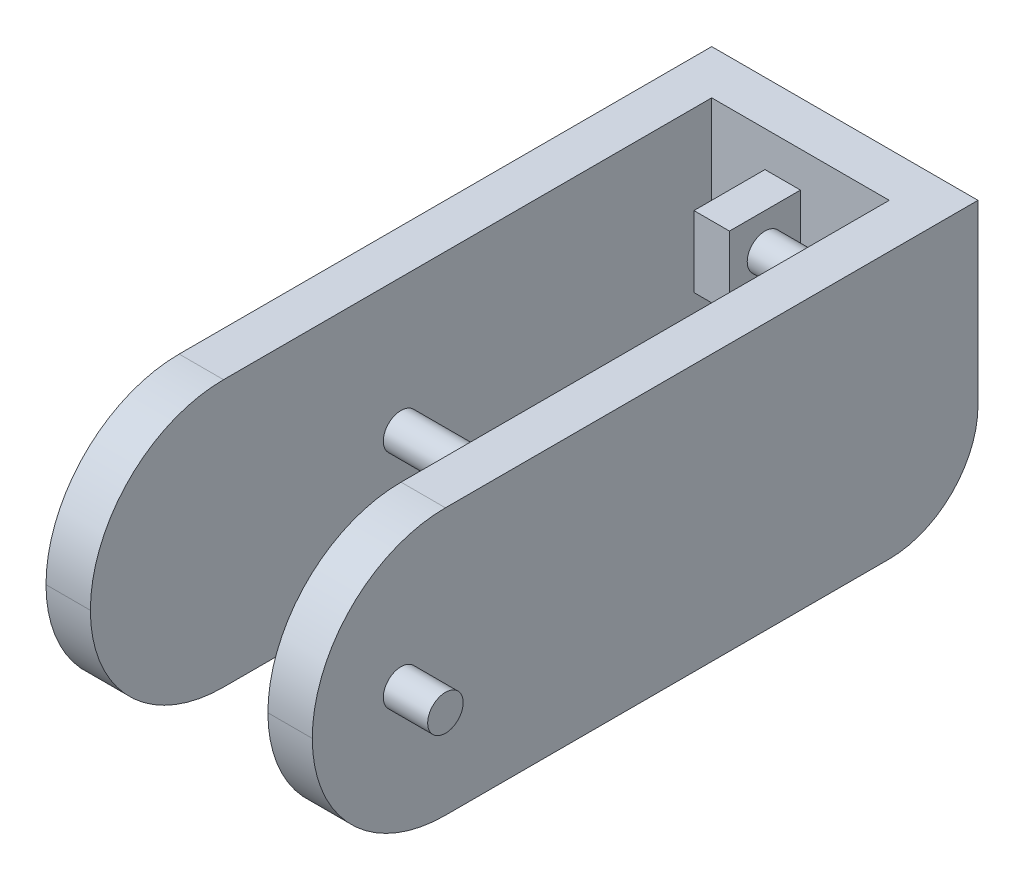
ISO-10303-21;
HEADER;
FILE_DESCRIPTION(('STEP AP214'),'2;1');
FILE_NAME('part.step','',(''),(''),'','','');
FILE_SCHEMA(('AUTOMOTIVE_DESIGN { 1 0 10303 214 1 1 1 1 }'));
ENDSEC;
DATA;
#1=APPLICATION_CONTEXT('core data for automotive mechanical design processes');
#2=APPLICATION_PROTOCOL_DEFINITION('international standard','automotive_design',2000,#1);
#3=PRODUCT_CONTEXT('',#1,'mechanical');
#4=PRODUCT('Part','Part','',(#3));
#5=PRODUCT_RELATED_PRODUCT_CATEGORY('part','',(#4));
#6=PRODUCT_DEFINITION_FORMATION('','',#4);
#7=PRODUCT_DEFINITION_CONTEXT('part definition',#1,'design');
#8=PRODUCT_DEFINITION('design','',#6,#7);
#9=PRODUCT_DEFINITION_SHAPE('','',#8);
#10=(LENGTH_UNIT() NAMED_UNIT(*) SI_UNIT(.MILLI.,.METRE.));
#11=(NAMED_UNIT(*) PLANE_ANGLE_UNIT() SI_UNIT($,.RADIAN.));
#12=(NAMED_UNIT(*) SI_UNIT($,.STERADIAN.) SOLID_ANGLE_UNIT());
#13=UNCERTAINTY_MEASURE_WITH_UNIT(LENGTH_MEASURE(1.E-05),#10,'distance_accuracy_value','');
#14=(GEOMETRIC_REPRESENTATION_CONTEXT(3) GLOBAL_UNCERTAINTY_ASSIGNED_CONTEXT((#13)) GLOBAL_UNIT_ASSIGNED_CONTEXT((#10,
#11,#12)) REPRESENTATION_CONTEXT('',''));
#15=CARTESIAN_POINT('',(0.,0.,0.));
#16=DIRECTION('',(0.,0.,1.));
#17=DIRECTION('',(1.,0.,0.));
#18=AXIS2_PLACEMENT_3D('',#15,#16,#17);
#19=CARTESIAN_POINT('',(-5.,15.,-17.5));
#20=DIRECTION('',(0.,0.,-1.));
#21=DIRECTION('',(-1.,0.,0.));
#22=AXIS2_PLACEMENT_3D('',#19,#20,#21);
#23=PLANE('',#22);
#24=DIRECTION('',(0.,-1.,0.));
#25=VECTOR('',#24,1.);
#26=CARTESIAN_POINT('',(-5.,15.,-17.5));
#27=LINE('',#26,#25);
#28=CARTESIAN_POINT('',(-5.,15.,-17.5));
#29=VERTEX_POINT('',#28);
#30=CARTESIAN_POINT('',(-5.,5.,-17.5));
#31=VERTEX_POINT('',#30);
#32=EDGE_CURVE('E232',#29,#31,#27,.T.);
#33=ORIENTED_EDGE('',*,*,#32,.T.);
#34=DIRECTION('',(-1.,0.,0.));
#35=VECTOR('',#34,1.);
#36=CARTESIAN_POINT('',(-5.,5.,-17.5));
#37=LINE('',#36,#35);
#38=CARTESIAN_POINT('',(5.,5.,-17.5));
#39=VERTEX_POINT('',#38);
#40=EDGE_CURVE('E190',#39,#31,#37,.T.);
#41=ORIENTED_EDGE('',*,*,#40,.F.);
#42=DIRECTION('',(0.,-1.,0.));
#43=VECTOR('',#42,1.);
#44=CARTESIAN_POINT('',(5.,15.,-17.5));
#45=LINE('',#44,#43);
#46=CARTESIAN_POINT('',(5.,15.,-17.5));
#47=VERTEX_POINT('',#46);
#48=EDGE_CURVE('E221',#47,#39,#45,.T.);
#49=ORIENTED_EDGE('',*,*,#48,.F.);
#50=DIRECTION('',(1.,0.,0.));
#51=VECTOR('',#50,1.);
#52=CARTESIAN_POINT('',(-5.,15.,-17.5));
#53=LINE('',#52,#51);
#54=EDGE_CURVE('E219',#29,#47,#53,.T.);
#55=ORIENTED_EDGE('',*,*,#54,.F.);
#56=EDGE_LOOP('',(#33,#41,#49,#55));
#57=FACE_BOUND('',#56,.T.);
#58=DIRECTION('',(0.,-1.,0.));
#59=VECTOR('',#58,1.);
#60=CARTESIAN_POINT('',(-2.,9.,-17.5));
#61=LINE('',#60,#59);
#62=CARTESIAN_POINT('',(-2.,13.,-17.5));
#63=VERTEX_POINT('',#62);
#64=CARTESIAN_POINT('',(-2.,9.,-17.5));
#65=VERTEX_POINT('',#64);
#66=EDGE_CURVE('E180',#63,#65,#61,.T.);
#67=ORIENTED_EDGE('',*,*,#66,.F.);
#68=DIRECTION('',(-1.,0.,0.));
#69=VECTOR('',#68,1.);
#70=CARTESIAN_POINT('',(0.,13.,-17.5));
#71=LINE('',#70,#69);
#72=CARTESIAN_POINT('',(0.,13.,-17.5));
#73=VERTEX_POINT('',#72);
#74=EDGE_CURVE('E177',#73,#63,#71,.T.);
#75=ORIENTED_EDGE('',*,*,#74,.F.);
#76=DIRECTION('',(0.,1.,0.));
#77=VECTOR('',#76,1.);
#78=CARTESIAN_POINT('',(0.,9.,-17.5));
#79=LINE('',#78,#77);
#80=CARTESIAN_POINT('',(0.,9.,-17.5));
#81=VERTEX_POINT('',#80);
#82=EDGE_CURVE('E61',#81,#73,#79,.T.);
#83=ORIENTED_EDGE('',*,*,#82,.F.);
#84=DIRECTION('',(1.,0.,0.));
#85=VECTOR('',#84,1.);
#86=CARTESIAN_POINT('',(0.,9.,-17.5));
#87=LINE('',#86,#85);
#88=EDGE_CURVE('E56',#65,#81,#87,.T.);
#89=ORIENTED_EDGE('',*,*,#88,.F.);
#90=EDGE_LOOP('',(#67,#75,#83,#89));
#91=FACE_BOUND('',#90,.T.);
#92=ADVANCED_FACE('F41',(#57,#91),#23,.F.);
#93=CARTESIAN_POINT('',(0.,0.,0.));
#94=DIRECTION('',(0.,-1.,0.));
#95=DIRECTION('',(0.,0.,-1.));
#96=AXIS2_PLACEMENT_3D('',#93,#94,#95);
#97=PLANE('',#96);
#98=DIRECTION('',(0.,0.,1.));
#99=VECTOR('',#98,1.);
#100=CARTESIAN_POINT('',(5.,0.,17.5));
#101=LINE('',#100,#99);
#102=CARTESIAN_POINT('',(5.,0.,-15.));
#103=VERTEX_POINT('',#102);
#104=CARTESIAN_POINT('',(5.,0.,10.));
#105=VERTEX_POINT('',#104);
#106=EDGE_CURVE('E205',#103,#105,#101,.T.);
#107=ORIENTED_EDGE('',*,*,#106,.F.);
#108=DIRECTION('',(-1.,0.,0.));
#109=VECTOR('',#108,1.);
#110=CARTESIAN_POINT('',(7.5,0.,-15.));
#111=LINE('',#110,#109);
#112=CARTESIAN_POINT('',(7.5,0.,-15.));
#113=VERTEX_POINT('',#112);
#114=EDGE_CURVE('E286',#103,#113,#111,.F.);
#115=ORIENTED_EDGE('',*,*,#114,.T.);
#116=DIRECTION('',(0.,0.,-1.));
#117=VECTOR('',#116,1.);
#118=CARTESIAN_POINT('',(7.5,0.,17.5));
#119=LINE('',#118,#117);
#120=CARTESIAN_POINT('',(7.5,0.,10.));
#121=VERTEX_POINT('',#120);
#122=EDGE_CURVE('E223',#121,#113,#119,.T.);
#123=ORIENTED_EDGE('',*,*,#122,.F.);
#124=DIRECTION('',(1.,0.,0.));
#125=VECTOR('',#124,1.);
#126=CARTESIAN_POINT('',(5.,0.,10.));
#127=LINE('',#126,#125);
#128=EDGE_CURVE('E269',#121,#105,#127,.F.);
#129=ORIENTED_EDGE('',*,*,#128,.T.);
#130=EDGE_LOOP('',(#107,#115,#123,#129));
#131=FACE_BOUND('',#130,.T.);
#132=ADVANCED_FACE('F355',(#131),#97,.T.);
#133=CARTESIAN_POINT('',(5.,15.,17.5));
#134=DIRECTION('',(1.,0.,0.));
#135=DIRECTION('',(0.,0.,-1.));
#136=AXIS2_PLACEMENT_3D('',#133,#134,#135);
#137=PLANE('',#136);
#138=CARTESIAN_POINT('',(5.,7.5,0.));
#139=DIRECTION('',(1.,0.,0.));
#140=DIRECTION('',(0.,0.,-1.));
#141=AXIS2_PLACEMENT_3D('',#138,#139,#140);
#142=CIRCLE('',#141,1.);
#143=CARTESIAN_POINT('',(5.,7.5,-1.));
#144=VERTEX_POINT('',#143);
#145=EDGE_CURVE('E244',#144,#144,#142,.F.);
#146=ORIENTED_EDGE('',*,*,#145,.F.);
#147=EDGE_LOOP('',(#146));
#148=FACE_BOUND('',#147,.T.);
#149=DIRECTION('',(0.,0.,-1.));
#150=VECTOR('',#149,1.);
#151=CARTESIAN_POINT('',(5.,5.,17.501));
#152=LINE('',#151,#150);
#153=CARTESIAN_POINT('',(5.,5.,-20.));
#154=VERTEX_POINT('',#153);
#155=EDGE_CURVE('E197',#39,#154,#152,.T.);
#156=ORIENTED_EDGE('',*,*,#155,.T.);
#157=CARTESIAN_POINT('',(5.,5.,-15.));
#158=DIRECTION('',(1.,0.,0.));
#159=DIRECTION('',(0.,0.,-1.));
#160=AXIS2_PLACEMENT_3D('',#157,#158,#159);
#161=CIRCLE('',#160,5.);
#162=EDGE_CURVE('E284',#154,#103,#161,.F.);
#163=ORIENTED_EDGE('',*,*,#162,.T.);
#164=ORIENTED_EDGE('',*,*,#106,.T.);
#165=CARTESIAN_POINT('',(5.,7.5,10.));
#166=DIRECTION('',(1.,0.,0.));
#167=DIRECTION('',(0.,0.,-1.));
#168=AXIS2_PLACEMENT_3D('',#165,#166,#167);
#169=CIRCLE('',#168,7.5);
#170=CARTESIAN_POINT('',(5.,7.5,17.5));
#171=VERTEX_POINT('',#170);
#172=EDGE_CURVE('E274',#105,#171,#169,.F.);
#173=ORIENTED_EDGE('',*,*,#172,.T.);
#174=CARTESIAN_POINT('',(5.,7.5,10.));
#175=DIRECTION('',(1.,0.,0.));
#176=DIRECTION('',(0.,0.,-1.));
#177=AXIS2_PLACEMENT_3D('',#174,#175,#176);
#178=CIRCLE('',#177,7.5);
#179=CARTESIAN_POINT('',(5.,15.,10.));
#180=VERTEX_POINT('',#179);
#181=EDGE_CURVE('E272',#171,#180,#178,.F.);
#182=ORIENTED_EDGE('',*,*,#181,.T.);
#183=DIRECTION('',(0.,0.,1.));
#184=VECTOR('',#183,1.);
#185=CARTESIAN_POINT('',(5.,15.,17.5));
#186=LINE('',#185,#184);
#187=EDGE_CURVE('E206',#47,#180,#186,.T.);
#188=ORIENTED_EDGE('',*,*,#187,.F.);
#189=ORIENTED_EDGE('',*,*,#48,.T.);
#190=EDGE_LOOP('',(#156,#163,#164,#173,#182,#188,#189));
#191=FACE_BOUND('',#190,.T.);
#192=ADVANCED_FACE('F352',(#148,#191),#137,.F.);
#193=CARTESIAN_POINT('',(7.5,15.,17.5));
#194=DIRECTION('',(-1.,0.,0.));
#195=DIRECTION('',(0.,0.,1.));
#196=AXIS2_PLACEMENT_3D('',#193,#194,#195);
#197=PLANE('',#196);
#198=CARTESIAN_POINT('',(7.5,7.5,12.5));
#199=DIRECTION('',(-1.,0.,0.));
#200=DIRECTION('',(0.,0.,1.));
#201=AXIS2_PLACEMENT_3D('',#198,#199,#200);
#202=CIRCLE('',#201,1.);
#203=CARTESIAN_POINT('',(7.5,7.5,13.5));
#204=VERTEX_POINT('',#203);
#205=EDGE_CURVE('E247',#204,#204,#202,.F.);
#206=ORIENTED_EDGE('',*,*,#205,.F.);
#207=EDGE_LOOP('',(#206));
#208=FACE_BOUND('',#207,.T.);
#209=ORIENTED_EDGE('',*,*,#122,.T.);
#210=CARTESIAN_POINT('',(7.5,5.,-15.));
#211=DIRECTION('',(-1.,0.,0.));
#212=DIRECTION('',(0.,0.,1.));
#213=AXIS2_PLACEMENT_3D('',#210,#211,#212);
#214=CIRCLE('',#213,5.);
#215=CARTESIAN_POINT('',(7.5,5.,-20.));
#216=VERTEX_POINT('',#215);
#217=EDGE_CURVE('E288',#113,#216,#214,.F.);
#218=ORIENTED_EDGE('',*,*,#217,.T.);
#219=DIRECTION('',(0.,-1.,0.));
#220=VECTOR('',#219,1.);
#221=CARTESIAN_POINT('',(7.5,15.,-20.));
#222=LINE('',#221,#220);
#223=CARTESIAN_POINT('',(7.5,15.,-20.));
#224=VERTEX_POINT('',#223);
#225=EDGE_CURVE('E238',#224,#216,#222,.T.);
#226=ORIENTED_EDGE('',*,*,#225,.F.);
#227=DIRECTION('',(0.,0.,-1.));
#228=VECTOR('',#227,1.);
#229=CARTESIAN_POINT('',(7.5,15.,17.5));
#230=LINE('',#229,#228);
#231=CARTESIAN_POINT('',(7.5,15.,10.));
#232=VERTEX_POINT('',#231);
#233=EDGE_CURVE('E209',#232,#224,#230,.T.);
#234=ORIENTED_EDGE('',*,*,#233,.F.);
#235=CARTESIAN_POINT('',(7.5,7.5,10.));
#236=DIRECTION('',(-1.,0.,0.));
#237=DIRECTION('',(0.,0.,1.));
#238=AXIS2_PLACEMENT_3D('',#235,#236,#237);
#239=CIRCLE('',#238,7.5);
#240=CARTESIAN_POINT('',(7.5,7.5,17.5));
#241=VERTEX_POINT('',#240);
#242=EDGE_CURVE('E265',#232,#241,#239,.F.);
#243=ORIENTED_EDGE('',*,*,#242,.T.);
#244=CARTESIAN_POINT('',(7.5,7.5,10.));
#245=DIRECTION('',(-1.,0.,0.));
#246=DIRECTION('',(0.,0.,1.));
#247=AXIS2_PLACEMENT_3D('',#244,#245,#246);
#248=CIRCLE('',#247,7.5);
#249=EDGE_CURVE('E267',#241,#121,#248,.F.);
#250=ORIENTED_EDGE('',*,*,#249,.T.);
#251=EDGE_LOOP('',(#209,#218,#226,#234,#243,#250));
#252=FACE_BOUND('',#251,.T.);
#253=ADVANCED_FACE('F343',(#208,#252),#197,.F.);
#254=CARTESIAN_POINT('',(-7.5,15.,-20.));
#255=DIRECTION('',(0.,0.,1.));
#256=DIRECTION('',(1.,0.,0.));
#257=AXIS2_PLACEMENT_3D('',#254,#255,#256);
#258=PLANE('',#257);
#259=ORIENTED_EDGE('',*,*,#225,.T.);
#260=DIRECTION('',(-1.,0.,0.));
#261=VECTOR('',#260,1.);
#262=CARTESIAN_POINT('',(5.,5.,-20.));
#263=LINE('',#262,#261);
#264=EDGE_CURVE('E281',#216,#154,#263,.T.);
#265=ORIENTED_EDGE('',*,*,#264,.T.);
#266=DIRECTION('',(1.,0.,0.));
#267=VECTOR('',#266,1.);
#268=CARTESIAN_POINT('',(-5.,5.,-20.));
#269=LINE('',#268,#267);
#270=CARTESIAN_POINT('',(-5.,5.,-20.));
#271=VERTEX_POINT('',#270);
#272=EDGE_CURVE('E193',#271,#154,#269,.T.);
#273=ORIENTED_EDGE('',*,*,#272,.F.);
#274=DIRECTION('',(-1.,0.,0.));
#275=VECTOR('',#274,1.);
#276=CARTESIAN_POINT('',(-7.5,5.,-20.));
#277=LINE('',#276,#275);
#278=CARTESIAN_POINT('',(-7.5,5.,-20.));
#279=VERTEX_POINT('',#278);
#280=EDGE_CURVE('E276',#271,#279,#277,.T.);
#281=ORIENTED_EDGE('',*,*,#280,.T.);
#282=DIRECTION('',(0.,-1.,0.));
#283=VECTOR('',#282,1.);
#284=CARTESIAN_POINT('',(-7.5,15.,-20.));
#285=LINE('',#284,#283);
#286=CARTESIAN_POINT('',(-7.5,15.,-20.));
#287=VERTEX_POINT('',#286);
#288=EDGE_CURVE('E235',#287,#279,#285,.T.);
#289=ORIENTED_EDGE('',*,*,#288,.F.);
#290=DIRECTION('',(-1.,0.,0.));
#291=VECTOR('',#290,1.);
#292=CARTESIAN_POINT('',(-7.5,15.,-20.));
#293=LINE('',#292,#291);
#294=EDGE_CURVE('E212',#224,#287,#293,.T.);
#295=ORIENTED_EDGE('',*,*,#294,.F.);
#296=EDGE_LOOP('',(#259,#265,#273,#281,#289,#295));
#297=FACE_BOUND('',#296,.T.);
#298=ADVANCED_FACE('F306',(#297),#258,.F.);
#299=CARTESIAN_POINT('',(-7.5,15.,17.5));
#300=DIRECTION('',(1.,0.,0.));
#301=DIRECTION('',(0.,0.,-1.));
#302=AXIS2_PLACEMENT_3D('',#299,#300,#301);
#303=PLANE('',#302);
#304=ORIENTED_EDGE('',*,*,#288,.T.);
#305=CARTESIAN_POINT('',(-7.5,5.,-15.));
#306=DIRECTION('',(1.,0.,0.));
#307=DIRECTION('',(0.,0.,-1.));
#308=AXIS2_PLACEMENT_3D('',#305,#306,#307);
#309=CIRCLE('',#308,5.);
#310=CARTESIAN_POINT('',(-7.5,0.,-15.));
#311=VERTEX_POINT('',#310);
#312=EDGE_CURVE('E290',#279,#311,#309,.F.);
#313=ORIENTED_EDGE('',*,*,#312,.T.);
#314=DIRECTION('',(0.,0.,1.));
#315=VECTOR('',#314,1.);
#316=CARTESIAN_POINT('',(-7.5,0.,17.5));
#317=LINE('',#316,#315);
#318=CARTESIAN_POINT('',(-7.5,0.,10.));
#319=VERTEX_POINT('',#318);
#320=EDGE_CURVE('E226',#311,#319,#317,.T.);
#321=ORIENTED_EDGE('',*,*,#320,.T.);
#322=CARTESIAN_POINT('',(-7.5,7.5,10.));
#323=DIRECTION('',(1.,0.,0.));
#324=DIRECTION('',(0.,0.,-1.));
#325=AXIS2_PLACEMENT_3D('',#322,#323,#324);
#326=CIRCLE('',#325,7.5);
#327=CARTESIAN_POINT('',(-7.5,7.5,17.5));
#328=VERTEX_POINT('',#327);
#329=EDGE_CURVE('E259',#319,#328,#326,.F.);
#330=ORIENTED_EDGE('',*,*,#329,.T.);
#331=CARTESIAN_POINT('',(-7.5,7.5,10.));
#332=DIRECTION('',(1.,0.,0.));
#333=DIRECTION('',(0.,0.,-1.));
#334=AXIS2_PLACEMENT_3D('',#331,#332,#333);
#335=CIRCLE('',#334,7.5);
#336=CARTESIAN_POINT('',(-7.5,15.,10.));
#337=VERTEX_POINT('',#336);
#338=EDGE_CURVE('E257',#328,#337,#335,.F.);
#339=ORIENTED_EDGE('',*,*,#338,.T.);
#340=DIRECTION('',(0.,0.,1.));
#341=VECTOR('',#340,1.);
#342=CARTESIAN_POINT('',(-7.5,15.,17.5));
#343=LINE('',#342,#341);
#344=EDGE_CURVE('E214',#287,#337,#343,.T.);
#345=ORIENTED_EDGE('',*,*,#344,.F.);
#346=EDGE_LOOP('',(#304,#313,#321,#330,#339,#345));
#347=FACE_BOUND('',#346,.T.);
#348=ADVANCED_FACE('F311',(#347),#303,.F.);
#349=CARTESIAN_POINT('',(-5.,15.,17.5));
#350=DIRECTION('',(-1.,0.,0.));
#351=DIRECTION('',(0.,0.,1.));
#352=AXIS2_PLACEMENT_3D('',#349,#350,#351);
#353=PLANE('',#352);
#354=CARTESIAN_POINT('',(-5.,7.5,0.));
#355=DIRECTION('',(-1.,0.,0.));
#356=DIRECTION('',(0.,0.,1.));
#357=AXIS2_PLACEMENT_3D('',#354,#355,#356);
#358=CIRCLE('',#357,1.);
#359=CARTESIAN_POINT('',(-5.,7.5,1.));
#360=VERTEX_POINT('',#359);
#361=EDGE_CURVE('E241',#360,#360,#358,.F.);
#362=ORIENTED_EDGE('',*,*,#361,.F.);
#363=EDGE_LOOP('',(#362));
#364=FACE_BOUND('',#363,.T.);
#365=DIRECTION('',(0.,0.,-1.));
#366=VECTOR('',#365,1.);
#367=CARTESIAN_POINT('',(-5.,0.,17.5));
#368=LINE('',#367,#366);
#369=CARTESIAN_POINT('',(-5.,0.,10.));
#370=VERTEX_POINT('',#369);
#371=CARTESIAN_POINT('',(-5.,0.,-15.));
#372=VERTEX_POINT('',#371);
#373=EDGE_CURVE('E210',#370,#372,#368,.T.);
#374=ORIENTED_EDGE('',*,*,#373,.T.);
#375=CARTESIAN_POINT('',(-5.,5.,-15.));
#376=DIRECTION('',(-1.,0.,0.));
#377=DIRECTION('',(0.,0.,1.));
#378=AXIS2_PLACEMENT_3D('',#375,#376,#377);
#379=CIRCLE('',#378,5.);
#380=EDGE_CURVE('E49',#372,#271,#379,.F.);
#381=ORIENTED_EDGE('',*,*,#380,.T.);
#382=DIRECTION('',(0.,0.,-1.));
#383=VECTOR('',#382,1.);
#384=CARTESIAN_POINT('',(-5.,5.,17.501));
#385=LINE('',#384,#383);
#386=EDGE_CURVE('E196',#31,#271,#385,.T.);
#387=ORIENTED_EDGE('',*,*,#386,.F.);
#388=ORIENTED_EDGE('',*,*,#32,.F.);
#389=DIRECTION('',(0.,0.,-1.));
#390=VECTOR('',#389,1.);
#391=CARTESIAN_POINT('',(-5.,15.,17.5));
#392=LINE('',#391,#390);
#393=CARTESIAN_POINT('',(-5.,15.,10.));
#394=VERTEX_POINT('',#393);
#395=EDGE_CURVE('E217',#394,#29,#392,.T.);
#396=ORIENTED_EDGE('',*,*,#395,.F.);
#397=CARTESIAN_POINT('',(-5.,7.5,10.));
#398=DIRECTION('',(-1.,0.,0.));
#399=DIRECTION('',(0.,0.,1.));
#400=AXIS2_PLACEMENT_3D('',#397,#398,#399);
#401=CIRCLE('',#400,7.5);
#402=CARTESIAN_POINT('',(-5.,7.5,17.5));
#403=VERTEX_POINT('',#402);
#404=EDGE_CURVE('E250',#394,#403,#401,.F.);
#405=ORIENTED_EDGE('',*,*,#404,.T.);
#406=CARTESIAN_POINT('',(-5.,7.5,10.));
#407=DIRECTION('',(-1.,0.,0.));
#408=DIRECTION('',(0.,0.,1.));
#409=AXIS2_PLACEMENT_3D('',#406,#407,#408);
#410=CIRCLE('',#409,7.5);
#411=EDGE_CURVE('E252',#403,#370,#410,.F.);
#412=ORIENTED_EDGE('',*,*,#411,.T.);
#413=EDGE_LOOP('',(#374,#381,#387,#388,#396,#405,#412));
#414=FACE_BOUND('',#413,.T.);
#415=ADVANCED_FACE('F295',(#364,#414),#353,.F.);
#416=CARTESIAN_POINT('',(0.,15.,0.));
#417=DIRECTION('',(0.,-1.,0.));
#418=DIRECTION('',(0.,0.,-1.));
#419=AXIS2_PLACEMENT_3D('',#416,#417,#418);
#420=PLANE('',#419);
#421=ORIENTED_EDGE('',*,*,#344,.T.);
#422=DIRECTION('',(1.,0.,0.));
#423=VECTOR('',#422,1.);
#424=CARTESIAN_POINT('',(0.,15.,10.));
#425=LINE('',#424,#423);
#426=EDGE_CURVE('E263',#337,#394,#425,.T.);
#427=ORIENTED_EDGE('',*,*,#426,.T.);
#428=ORIENTED_EDGE('',*,*,#395,.T.);
#429=ORIENTED_EDGE('',*,*,#54,.T.);
#430=ORIENTED_EDGE('',*,*,#187,.T.);
#431=DIRECTION('',(1.,0.,0.));
#432=VECTOR('',#431,1.);
#433=CARTESIAN_POINT('',(0.,15.,10.));
#434=LINE('',#433,#432);
#435=EDGE_CURVE('E261',#180,#232,#434,.T.);
#436=ORIENTED_EDGE('',*,*,#435,.T.);
#437=ORIENTED_EDGE('',*,*,#233,.T.);
#438=ORIENTED_EDGE('',*,*,#294,.T.);
#439=EDGE_LOOP('',(#421,#427,#428,#429,#430,#436,#437,#438));
#440=FACE_BOUND('',#439,.T.);
#441=ADVANCED_FACE('F328',(#440),#420,.F.);
#442=ORIENTED_EDGE('',*,*,#320,.F.);
#443=DIRECTION('',(-1.,0.,0.));
#444=VECTOR('',#443,1.);
#445=CARTESIAN_POINT('',(-5.,0.,-15.));
#446=LINE('',#445,#444);
#447=EDGE_CURVE('E292',#311,#372,#446,.F.);
#448=ORIENTED_EDGE('',*,*,#447,.T.);
#449=ORIENTED_EDGE('',*,*,#373,.F.);
#450=DIRECTION('',(1.,0.,0.));
#451=VECTOR('',#450,1.);
#452=CARTESIAN_POINT('',(-7.5,0.,10.));
#453=LINE('',#452,#451);
#454=EDGE_CURVE('E254',#370,#319,#453,.F.);
#455=ORIENTED_EDGE('',*,*,#454,.T.);
#456=EDGE_LOOP('',(#442,#448,#449,#455));
#457=FACE_BOUND('',#456,.T.);
#458=ADVANCED_FACE('F315',(#457),#97,.T.);
#459=CARTESIAN_POINT('',(-5.,7.5,0.));
#460=DIRECTION('',(1.,0.,0.));
#461=DIRECTION('',(0.,0.,-1.));
#462=AXIS2_PLACEMENT_3D('',#459,#460,#461);
#463=CYLINDRICAL_SURFACE('',#462,1.);
#464=ORIENTED_EDGE('',*,*,#361,.T.);
#465=EDGE_LOOP('',(#464));
#466=FACE_BOUND('',#465,.T.);
#467=ORIENTED_EDGE('',*,*,#145,.T.);
#468=EDGE_LOOP('',(#467));
#469=FACE_BOUND('',#468,.T.);
#470=ADVANCED_FACE('F410',(#466,#469),#463,.T.);
#471=CARTESIAN_POINT('',(10.,7.5,12.5));
#472=DIRECTION('',(-1.,0.,0.));
#473=DIRECTION('',(0.,0.,1.));
#474=AXIS2_PLACEMENT_3D('',#471,#472,#473);
#475=CYLINDRICAL_SURFACE('',#474,1.);
#476=CARTESIAN_POINT('',(10.,7.5,12.5));
#477=DIRECTION('',(1.,0.,0.));
#478=DIRECTION('',(0.,0.,-1.));
#479=AXIS2_PLACEMENT_3D('',#476,#477,#478);
#480=CIRCLE('',#479,1.);
#481=CARTESIAN_POINT('',(10.,7.5,11.5));
#482=VERTEX_POINT('',#481);
#483=EDGE_CURVE('E200',#482,#482,#480,.T.);
#484=ORIENTED_EDGE('',*,*,#483,.F.);
#485=EDGE_LOOP('',(#484));
#486=FACE_BOUND('',#485,.T.);
#487=ORIENTED_EDGE('',*,*,#205,.T.);
#488=EDGE_LOOP('',(#487));
#489=FACE_BOUND('',#488,.T.);
#490=ADVANCED_FACE('F402',(#486,#489),#475,.T.);
#491=CARTESIAN_POINT('',(10.,7.5,12.5));
#492=DIRECTION('',(1.,0.,0.));
#493=DIRECTION('',(0.,0.,-1.));
#494=AXIS2_PLACEMENT_3D('',#491,#492,#493);
#495=PLANE('',#494);
#496=ORIENTED_EDGE('',*,*,#483,.T.);
#497=EDGE_LOOP('',(#496));
#498=FACE_BOUND('',#497,.T.);
#499=ADVANCED_FACE('F396',(#498),#495,.T.);
#500=CARTESIAN_POINT('',(-5.,5.,17.501));
#501=DIRECTION('',(0.,1.,0.));
#502=DIRECTION('',(-1.,0.,0.));
#503=AXIS2_PLACEMENT_3D('',#500,#501,#502);
#504=PLANE('',#503);
#505=ORIENTED_EDGE('',*,*,#40,.T.);
#506=ORIENTED_EDGE('',*,*,#386,.T.);
#507=ORIENTED_EDGE('',*,*,#272,.T.);
#508=ORIENTED_EDGE('',*,*,#155,.F.);
#509=EDGE_LOOP('',(#505,#506,#507,#508));
#510=FACE_BOUND('',#509,.T.);
#511=ADVANCED_FACE('F303',(#510),#504,.F.);
#512=CARTESIAN_POINT('',(0.,7.5,10.));
#513=DIRECTION('',(1.,0.,0.));
#514=DIRECTION('',(0.,0.,-1.));
#515=AXIS2_PLACEMENT_3D('',#512,#513,#514);
#516=CYLINDRICAL_SURFACE('',#515,7.5);
#517=ORIENTED_EDGE('',*,*,#426,.F.);
#518=ORIENTED_EDGE('',*,*,#338,.F.);
#519=DIRECTION('',(1.,0.,0.));
#520=VECTOR('',#519,1.);
#521=CARTESIAN_POINT('',(-5.,7.5,17.5));
#522=LINE('',#521,#520);
#523=EDGE_CURVE('E184',#403,#328,#522,.F.);
#524=ORIENTED_EDGE('',*,*,#523,.F.);
#525=ORIENTED_EDGE('',*,*,#404,.F.);
#526=EDGE_LOOP('',(#517,#518,#524,#525));
#527=FACE_BOUND('',#526,.T.);
#528=ADVANCED_FACE('F324',(#527),#516,.T.);
#529=CARTESIAN_POINT('',(-5.,7.5,10.));
#530=DIRECTION('',(-1.,0.,0.));
#531=DIRECTION('',(0.,0.,1.));
#532=AXIS2_PLACEMENT_3D('',#529,#530,#531);
#533=CYLINDRICAL_SURFACE('',#532,7.5);
#534=ORIENTED_EDGE('',*,*,#329,.F.);
#535=ORIENTED_EDGE('',*,*,#454,.F.);
#536=ORIENTED_EDGE('',*,*,#411,.F.);
#537=ORIENTED_EDGE('',*,*,#523,.T.);
#538=EDGE_LOOP('',(#534,#535,#536,#537));
#539=FACE_BOUND('',#538,.T.);
#540=ADVANCED_FACE('F319',(#539),#533,.T.);
#541=CARTESIAN_POINT('',(0.,7.5,10.));
#542=DIRECTION('',(1.,0.,0.));
#543=DIRECTION('',(0.,0.,-1.));
#544=AXIS2_PLACEMENT_3D('',#541,#542,#543);
#545=CYLINDRICAL_SURFACE('',#544,7.5);
#546=ORIENTED_EDGE('',*,*,#435,.F.);
#547=ORIENTED_EDGE('',*,*,#181,.F.);
#548=DIRECTION('',(1.,0.,0.));
#549=VECTOR('',#548,1.);
#550=CARTESIAN_POINT('',(5.,7.5,17.5));
#551=LINE('',#550,#549);
#552=EDGE_CURVE('E181',#241,#171,#551,.F.);
#553=ORIENTED_EDGE('',*,*,#552,.F.);
#554=ORIENTED_EDGE('',*,*,#242,.F.);
#555=EDGE_LOOP('',(#546,#547,#553,#554));
#556=FACE_BOUND('',#555,.T.);
#557=ADVANCED_FACE('F339',(#556),#545,.T.);
#558=CARTESIAN_POINT('',(5.,7.5,10.));
#559=DIRECTION('',(-1.,0.,0.));
#560=DIRECTION('',(0.,0.,1.));
#561=AXIS2_PLACEMENT_3D('',#558,#559,#560);
#562=CYLINDRICAL_SURFACE('',#561,7.5);
#563=ORIENTED_EDGE('',*,*,#172,.F.);
#564=ORIENTED_EDGE('',*,*,#128,.F.);
#565=ORIENTED_EDGE('',*,*,#249,.F.);
#566=ORIENTED_EDGE('',*,*,#552,.T.);
#567=EDGE_LOOP('',(#563,#564,#565,#566));
#568=FACE_BOUND('',#567,.T.);
#569=ADVANCED_FACE('F358',(#568),#562,.T.);
#570=CARTESIAN_POINT('',(-7.5,5.,-15.));
#571=DIRECTION('',(1.,0.,0.));
#572=DIRECTION('',(0.,0.,-1.));
#573=AXIS2_PLACEMENT_3D('',#570,#571,#572);
#574=CYLINDRICAL_SURFACE('',#573,5.);
#575=ORIENTED_EDGE('',*,*,#217,.F.);
#576=ORIENTED_EDGE('',*,*,#114,.F.);
#577=ORIENTED_EDGE('',*,*,#162,.F.);
#578=ORIENTED_EDGE('',*,*,#264,.F.);
#579=EDGE_LOOP('',(#575,#576,#577,#578));
#580=FACE_BOUND('',#579,.T.);
#581=ADVANCED_FACE('F349',(#580),#574,.T.);
#582=CARTESIAN_POINT('',(-7.5,5.,-15.));
#583=DIRECTION('',(1.,0.,0.));
#584=DIRECTION('',(0.,0.,-1.));
#585=AXIS2_PLACEMENT_3D('',#582,#583,#584);
#586=CYLINDRICAL_SURFACE('',#585,5.);
#587=ORIENTED_EDGE('',*,*,#380,.F.);
#588=ORIENTED_EDGE('',*,*,#447,.F.);
#589=ORIENTED_EDGE('',*,*,#312,.F.);
#590=ORIENTED_EDGE('',*,*,#280,.F.);
#591=EDGE_LOOP('',(#587,#588,#589,#590));
#592=FACE_BOUND('',#591,.T.);
#593=ADVANCED_FACE('F43',(#592),#586,.T.);
#594=CARTESIAN_POINT('',(-2.,9.,-13.5));
#595=DIRECTION('',(1.,0.,0.));
#596=DIRECTION('',(0.,1.,0.));
#597=AXIS2_PLACEMENT_3D('',#594,#595,#596);
#598=PLANE('',#597);
#599=ORIENTED_EDGE('',*,*,#66,.T.);
#600=DIRECTION('',(0.,0.,-1.));
#601=VECTOR('',#600,1.);
#602=CARTESIAN_POINT('',(-2.,9.,-13.5));
#603=LINE('',#602,#601);
#604=CARTESIAN_POINT('',(-2.,9.,-13.5));
#605=VERTEX_POINT('',#604);
#606=EDGE_CURVE('E161',#605,#65,#603,.T.);
#607=ORIENTED_EDGE('',*,*,#606,.F.);
#608=DIRECTION('',(0.,-1.,0.));
#609=VECTOR('',#608,1.);
#610=CARTESIAN_POINT('',(-2.,9.,-13.5));
#611=LINE('',#610,#609);
#612=CARTESIAN_POINT('',(-2.,13.,-13.5));
#613=VERTEX_POINT('',#612);
#614=EDGE_CURVE('E168',#613,#605,#611,.T.);
#615=ORIENTED_EDGE('',*,*,#614,.F.);
#616=DIRECTION('',(0.,0.,-1.));
#617=VECTOR('',#616,1.);
#618=CARTESIAN_POINT('',(-2.,13.,-13.5));
#619=LINE('',#618,#617);
#620=EDGE_CURVE('E561',#613,#63,#619,.T.);
#621=ORIENTED_EDGE('',*,*,#620,.T.);
#622=EDGE_LOOP('',(#599,#607,#615,#621));
#623=FACE_BOUND('',#622,.T.);
#624=ADVANCED_FACE('F179',(#623),#598,.F.);
#625=CARTESIAN_POINT('',(0.,9.,-13.5));
#626=DIRECTION('',(0.,1.,0.));
#627=DIRECTION('',(0.,0.,1.));
#628=AXIS2_PLACEMENT_3D('',#625,#626,#627);
#629=PLANE('',#628);
#630=ORIENTED_EDGE('',*,*,#88,.T.);
#631=DIRECTION('',(0.,0.,-1.));
#632=VECTOR('',#631,1.);
#633=CARTESIAN_POINT('',(0.,9.,-13.5));
#634=LINE('',#633,#632);
#635=CARTESIAN_POINT('',(0.,9.,-13.5));
#636=VERTEX_POINT('',#635);
#637=EDGE_CURVE('E164',#636,#81,#634,.T.);
#638=ORIENTED_EDGE('',*,*,#637,.F.);
#639=DIRECTION('',(1.,0.,0.));
#640=VECTOR('',#639,1.);
#641=CARTESIAN_POINT('',(0.,9.,-13.5));
#642=LINE('',#641,#640);
#643=EDGE_CURVE('E157',#605,#636,#642,.T.);
#644=ORIENTED_EDGE('',*,*,#643,.F.);
#645=ORIENTED_EDGE('',*,*,#606,.T.);
#646=EDGE_LOOP('',(#630,#638,#644,#645));
#647=FACE_BOUND('',#646,.T.);
#648=ADVANCED_FACE('F159',(#647),#629,.F.);
#649=CARTESIAN_POINT('',(0.,9.,-13.5));
#650=DIRECTION('',(-1.,0.,0.));
#651=DIRECTION('',(0.,-1.,0.));
#652=AXIS2_PLACEMENT_3D('',#649,#650,#651);
#653=PLANE('',#652);
#654=CARTESIAN_POINT('',(0.,11.,-15.5));
#655=DIRECTION('',(-1.,0.,0.));
#656=DIRECTION('',(0.,-1.,0.));
#657=AXIS2_PLACEMENT_3D('',#654,#655,#656);
#658=CIRCLE('',#657,1.);
#659=CARTESIAN_POINT('',(0.,10.,-15.5));
#660=VERTEX_POINT('',#659);
#661=EDGE_CURVE('E11',#660,#660,#658,.F.);
#662=ORIENTED_EDGE('',*,*,#661,.F.);
#663=EDGE_LOOP('',(#662));
#664=FACE_BOUND('',#663,.T.);
#665=ORIENTED_EDGE('',*,*,#82,.T.);
#666=DIRECTION('',(0.,0.,-1.));
#667=VECTOR('',#666,1.);
#668=CARTESIAN_POINT('',(0.,13.,-13.5));
#669=LINE('',#668,#667);
#670=CARTESIAN_POINT('',(0.,13.,-13.5));
#671=VERTEX_POINT('',#670);
#672=EDGE_CURVE('E186',#671,#73,#669,.T.);
#673=ORIENTED_EDGE('',*,*,#672,.F.);
#674=DIRECTION('',(0.,1.,0.));
#675=VECTOR('',#674,1.);
#676=CARTESIAN_POINT('',(0.,9.,-13.5));
#677=LINE('',#676,#675);
#678=EDGE_CURVE('E167',#636,#671,#677,.T.);
#679=ORIENTED_EDGE('',*,*,#678,.F.);
#680=ORIENTED_EDGE('',*,*,#637,.T.);
#681=EDGE_LOOP('',(#665,#673,#679,#680));
#682=FACE_BOUND('',#681,.T.);
#683=ADVANCED_FACE('F503',(#664,#682),#653,.F.);
#684=CARTESIAN_POINT('',(0.,13.,-13.5));
#685=DIRECTION('',(0.,-1.,0.));
#686=DIRECTION('',(0.,0.,-1.));
#687=AXIS2_PLACEMENT_3D('',#684,#685,#686);
#688=PLANE('',#687);
#689=ORIENTED_EDGE('',*,*,#74,.T.);
#690=ORIENTED_EDGE('',*,*,#620,.F.);
#691=DIRECTION('',(-1.,0.,0.));
#692=VECTOR('',#691,1.);
#693=CARTESIAN_POINT('',(0.,13.,-13.5));
#694=LINE('',#693,#692);
#695=EDGE_CURVE('E173',#671,#613,#694,.T.);
#696=ORIENTED_EDGE('',*,*,#695,.F.);
#697=ORIENTED_EDGE('',*,*,#672,.T.);
#698=EDGE_LOOP('',(#689,#690,#696,#697));
#699=FACE_BOUND('',#698,.T.);
#700=ADVANCED_FACE('F510',(#699),#688,.F.);
#701=CARTESIAN_POINT('',(0.,0.,-13.5));
#702=DIRECTION('',(0.,0.,1.));
#703=DIRECTION('',(1.,0.,0.));
#704=AXIS2_PLACEMENT_3D('',#701,#702,#703);
#705=PLANE('',#704);
#706=ORIENTED_EDGE('',*,*,#614,.T.);
#707=ORIENTED_EDGE('',*,*,#643,.T.);
#708=ORIENTED_EDGE('',*,*,#678,.T.);
#709=ORIENTED_EDGE('',*,*,#695,.T.);
#710=EDGE_LOOP('',(#706,#707,#708,#709));
#711=FACE_BOUND('',#710,.T.);
#712=ADVANCED_FACE('F171',(#711),#705,.T.);
#713=CARTESIAN_POINT('',(2.,11.,-15.5));
#714=DIRECTION('',(-1.,0.,0.));
#715=DIRECTION('',(0.,-1.,0.));
#716=AXIS2_PLACEMENT_3D('',#713,#714,#715);
#717=CYLINDRICAL_SURFACE('',#716,1.);
#718=CARTESIAN_POINT('',(2.,11.,-15.5));
#719=DIRECTION('',(1.,0.,0.));
#720=DIRECTION('',(0.,1.,0.));
#721=AXIS2_PLACEMENT_3D('',#718,#719,#720);
#722=CIRCLE('',#721,1.);
#723=CARTESIAN_POINT('',(2.,12.,-15.5));
#724=VERTEX_POINT('',#723);
#725=EDGE_CURVE('E556',#724,#724,#722,.T.);
#726=ORIENTED_EDGE('',*,*,#725,.F.);
#727=EDGE_LOOP('',(#726));
#728=FACE_BOUND('',#727,.T.);
#729=ORIENTED_EDGE('',*,*,#661,.T.);
#730=EDGE_LOOP('',(#729));
#731=FACE_BOUND('',#730,.T.);
#732=ADVANCED_FACE('F527',(#728,#731),#717,.T.);
#733=CARTESIAN_POINT('',(2.,11.,-15.5));
#734=DIRECTION('',(1.,0.,0.));
#735=DIRECTION('',(0.,1.,0.));
#736=AXIS2_PLACEMENT_3D('',#733,#734,#735);
#737=PLANE('',#736);
#738=ORIENTED_EDGE('',*,*,#725,.T.);
#739=EDGE_LOOP('',(#738));
#740=FACE_BOUND('',#739,.T.);
#741=ADVANCED_FACE('F535',(#740),#737,.T.);
#742=CLOSED_SHELL('',(#92,#132,#192,#253,#298,#348,#415,#441,#458,#470,#490,#499,#511,#528,#540,
#557,#569,#581,#593,#624,#648,#683,#700,#712,#732,#741));
#743=MANIFOLD_SOLID_BREP('B2',#742);
#744=ADVANCED_BREP_SHAPE_REPRESENTATION('',(#18,#743),#14);
#745=SHAPE_DEFINITION_REPRESENTATION(#9,#744);
ENDSEC;
END-ISO-10303-21;
